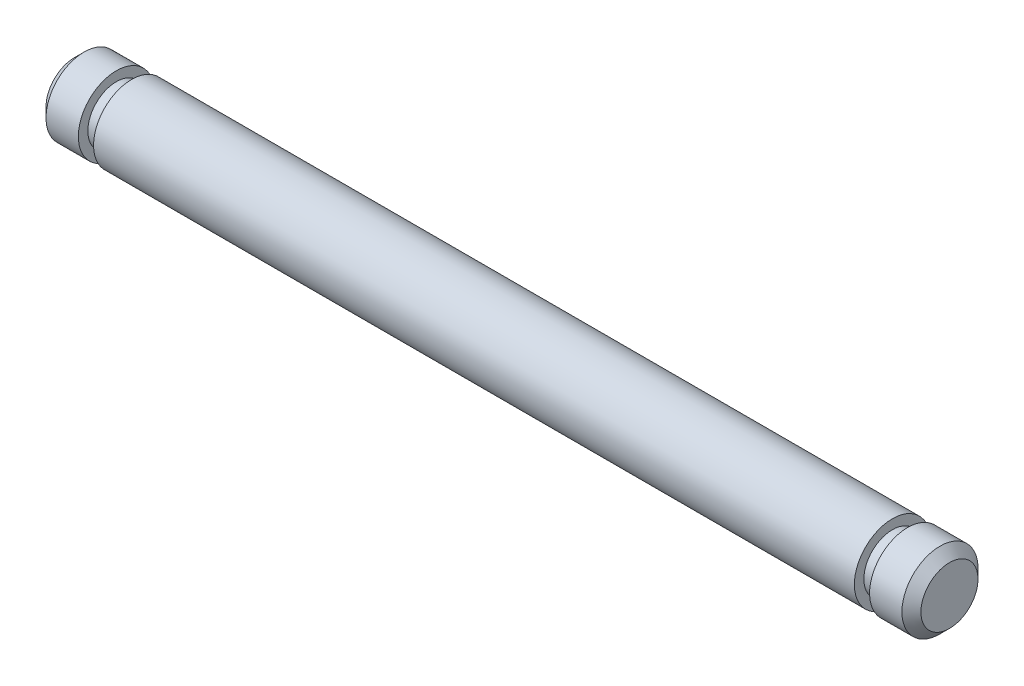
ISO-10303-21;
HEADER;
FILE_DESCRIPTION(('STEP AP214'),'2;1');
FILE_NAME('part.step','',(''),(''),'','','');
FILE_SCHEMA(('AUTOMOTIVE_DESIGN { 1 0 10303 214 1 1 1 1 }'));
ENDSEC;
DATA;
#1=APPLICATION_CONTEXT('core data for automotive mechanical design processes');
#2=APPLICATION_PROTOCOL_DEFINITION('international standard','automotive_design',2000,#1);
#3=PRODUCT_CONTEXT('',#1,'mechanical');
#4=PRODUCT('Part','Part','',(#3));
#5=PRODUCT_RELATED_PRODUCT_CATEGORY('part','',(#4));
#6=PRODUCT_DEFINITION_FORMATION('','',#4);
#7=PRODUCT_DEFINITION_CONTEXT('part definition',#1,'design');
#8=PRODUCT_DEFINITION('design','',#6,#7);
#9=PRODUCT_DEFINITION_SHAPE('','',#8);
#10=(LENGTH_UNIT() NAMED_UNIT(*) SI_UNIT(.MILLI.,.METRE.));
#11=(NAMED_UNIT(*) PLANE_ANGLE_UNIT() SI_UNIT($,.RADIAN.));
#12=(NAMED_UNIT(*) SI_UNIT($,.STERADIAN.) SOLID_ANGLE_UNIT());
#13=UNCERTAINTY_MEASURE_WITH_UNIT(LENGTH_MEASURE(1.E-05),#10,'distance_accuracy_value','');
#14=(GEOMETRIC_REPRESENTATION_CONTEXT(3) GLOBAL_UNCERTAINTY_ASSIGNED_CONTEXT((#13)) GLOBAL_UNIT_ASSIGNED_CONTEXT((#10,
#11,#12)) REPRESENTATION_CONTEXT('',''));
#15=CARTESIAN_POINT('',(0.,0.,0.));
#16=DIRECTION('',(0.,0.,1.));
#17=DIRECTION('',(1.,0.,0.));
#18=AXIS2_PLACEMENT_3D('',#15,#16,#17);
#19=CARTESIAN_POINT('',(46.,2.,0.));
#20=DIRECTION('',(1.,0.,0.));
#21=DIRECTION('',(0.,1.,0.));
#22=AXIS2_PLACEMENT_3D('',#19,#20,#21);
#23=CYLINDRICAL_SURFACE('',#22,2.);
#24=CARTESIAN_POINT('',(43.,2.,0.));
#25=DIRECTION('',(1.,0.,0.));
#26=DIRECTION('',(0.,1.,0.));
#27=AXIS2_PLACEMENT_3D('',#24,#25,#26);
#28=CIRCLE('',#27,2.);
#29=CARTESIAN_POINT('',(43.,4.,0.));
#30=VERTEX_POINT('',#29);
#31=EDGE_CURVE('E61',#30,#30,#28,.T.);
#32=ORIENTED_EDGE('',*,*,#31,.F.);
#33=EDGE_LOOP('',(#32));
#34=FACE_BOUND('',#33,.T.);
#35=CARTESIAN_POINT('',(3.,1.99999999999999,0.));
#36=DIRECTION('',(-1.,0.,0.));
#37=DIRECTION('',(0.,-1.,0.));
#38=AXIS2_PLACEMENT_3D('',#35,#36,#37);
#39=CIRCLE('',#38,1.99999999999999);
#40=CARTESIAN_POINT('',(3.,0.,0.));
#41=VERTEX_POINT('',#40);
#42=EDGE_CURVE('E73',#41,#41,#39,.T.);
#43=ORIENTED_EDGE('',*,*,#42,.F.);
#44=EDGE_LOOP('',(#43));
#45=FACE_BOUND('',#44,.T.);
#46=ADVANCED_FACE('F39',(#34,#45),#23,.T.);
#47=CARTESIAN_POINT('',(45.5,2.,0.));
#48=DIRECTION('',(-1.,0.,0.));
#49=DIRECTION('',(0.,0.,1.));
#50=AXIS2_PLACEMENT_3D('',#47,#48,#49);
#51=CIRCLE('',#50,2.);
#52=CARTESIAN_POINT('',(45.5,2.,2.));
#53=VERTEX_POINT('',#52);
#54=EDGE_CURVE('E10',#53,#53,#51,.T.);
#55=ORIENTED_EDGE('',*,*,#54,.T.);
#56=EDGE_LOOP('',(#55));
#57=FACE_BOUND('',#56,.T.);
#58=CARTESIAN_POINT('',(43.8,2.,0.));
#59=DIRECTION('',(1.,0.,0.));
#60=DIRECTION('',(0.,1.,0.));
#61=AXIS2_PLACEMENT_3D('',#58,#59,#60);
#62=CIRCLE('',#61,2.);
#63=CARTESIAN_POINT('',(43.8,4.,0.));
#64=VERTEX_POINT('',#63);
#65=EDGE_CURVE('E60',#64,#64,#62,.T.);
#66=ORIENTED_EDGE('',*,*,#65,.T.);
#67=EDGE_LOOP('',(#66));
#68=FACE_BOUND('',#67,.T.);
#69=ADVANCED_FACE('F106',(#57,#68),#23,.T.);
#70=CARTESIAN_POINT('',(46.,0.,0.));
#71=DIRECTION('',(-1.,0.,0.));
#72=DIRECTION('',(0.,-1.,0.));
#73=AXIS2_PLACEMENT_3D('',#70,#71,#72);
#74=PLANE('',#73);
#75=CARTESIAN_POINT('',(46.,2.,0.));
#76=DIRECTION('',(-1.,0.,0.));
#77=DIRECTION('',(0.,-1.,0.));
#78=AXIS2_PLACEMENT_3D('',#75,#76,#77);
#79=CIRCLE('',#78,1.5);
#80=CARTESIAN_POINT('',(46.,0.499999999999999,0.));
#81=VERTEX_POINT('',#80);
#82=EDGE_CURVE('E47',#81,#81,#79,.F.);
#83=ORIENTED_EDGE('',*,*,#82,.T.);
#84=EDGE_LOOP('',(#83));
#85=FACE_BOUND('',#84,.T.);
#86=ADVANCED_FACE('F114',(#85),#74,.F.);
#87=CARTESIAN_POINT('',(43.8,2.,0.));
#88=DIRECTION('',(1.,0.,0.));
#89=DIRECTION('',(0.,1.,0.));
#90=AXIS2_PLACEMENT_3D('',#87,#88,#89);
#91=PLANE('',#90);
#92=ORIENTED_EDGE('',*,*,#65,.F.);
#93=EDGE_LOOP('',(#92));
#94=FACE_BOUND('',#93,.T.);
#95=CARTESIAN_POINT('',(43.8,2.,0.));
#96=DIRECTION('',(1.,0.,0.));
#97=DIRECTION('',(0.,1.,0.));
#98=AXIS2_PLACEMENT_3D('',#95,#96,#97);
#99=CIRCLE('',#98,1.5);
#100=CARTESIAN_POINT('',(43.8,3.5,0.));
#101=VERTEX_POINT('',#100);
#102=EDGE_CURVE('E64',#101,#101,#99,.T.);
#103=ORIENTED_EDGE('',*,*,#102,.T.);
#104=EDGE_LOOP('',(#103));
#105=FACE_BOUND('',#104,.T.);
#106=ADVANCED_FACE('F147',(#94,#105),#91,.F.);
#107=CARTESIAN_POINT('',(43.,2.,0.));
#108=DIRECTION('',(1.,0.,0.));
#109=DIRECTION('',(0.,1.,0.));
#110=AXIS2_PLACEMENT_3D('',#107,#108,#109);
#111=PLANE('',#110);
#112=ORIENTED_EDGE('',*,*,#31,.T.);
#113=EDGE_LOOP('',(#112));
#114=FACE_BOUND('',#113,.T.);
#115=CARTESIAN_POINT('',(43.,2.,0.));
#116=DIRECTION('',(1.,0.,0.));
#117=DIRECTION('',(0.,1.,0.));
#118=AXIS2_PLACEMENT_3D('',#115,#116,#117);
#119=CIRCLE('',#118,1.5);
#120=CARTESIAN_POINT('',(43.,3.5,0.));
#121=VERTEX_POINT('',#120);
#122=EDGE_CURVE('E67',#121,#121,#119,.T.);
#123=ORIENTED_EDGE('',*,*,#122,.F.);
#124=EDGE_LOOP('',(#123));
#125=FACE_BOUND('',#124,.T.);
#126=ADVANCED_FACE('F196',(#114,#125),#111,.T.);
#127=CARTESIAN_POINT('',(43.8,2.,0.));
#128=DIRECTION('',(-1.,0.,0.));
#129=DIRECTION('',(0.,-1.,0.));
#130=AXIS2_PLACEMENT_3D('',#127,#128,#129);
#131=CYLINDRICAL_SURFACE('',#130,1.5);
#132=ORIENTED_EDGE('',*,*,#102,.F.);
#133=EDGE_LOOP('',(#132));
#134=FACE_BOUND('',#133,.T.);
#135=ORIENTED_EDGE('',*,*,#122,.T.);
#136=EDGE_LOOP('',(#135));
#137=FACE_BOUND('',#136,.T.);
#138=ADVANCED_FACE('F101',(#134,#137),#131,.T.);
#139=CARTESIAN_POINT('',(2.2,1.99999999999999,0.));
#140=DIRECTION('',(-1.,0.,0.));
#141=DIRECTION('',(0.,-1.,0.));
#142=AXIS2_PLACEMENT_3D('',#139,#140,#141);
#143=PLANE('',#142);
#144=CARTESIAN_POINT('',(2.2,1.99999999999999,0.));
#145=DIRECTION('',(-1.,0.,0.));
#146=DIRECTION('',(0.,-1.,0.));
#147=AXIS2_PLACEMENT_3D('',#144,#145,#146);
#148=CIRCLE('',#147,1.99999999999999);
#149=CARTESIAN_POINT('',(2.2,0.,0.));
#150=VERTEX_POINT('',#149);
#151=EDGE_CURVE('E70',#150,#150,#148,.T.);
#152=ORIENTED_EDGE('',*,*,#151,.F.);
#153=EDGE_LOOP('',(#152));
#154=FACE_BOUND('',#153,.T.);
#155=CARTESIAN_POINT('',(2.2,1.99999999999999,0.));
#156=DIRECTION('',(-1.,0.,0.));
#157=DIRECTION('',(0.,-1.,0.));
#158=AXIS2_PLACEMENT_3D('',#155,#156,#157);
#159=CIRCLE('',#158,1.5);
#160=CARTESIAN_POINT('',(2.2,0.499999999999994,0.));
#161=VERTEX_POINT('',#160);
#162=EDGE_CURVE('E76',#161,#161,#159,.T.);
#163=ORIENTED_EDGE('',*,*,#162,.T.);
#164=EDGE_LOOP('',(#163));
#165=FACE_BOUND('',#164,.T.);
#166=ADVANCED_FACE('F85',(#154,#165),#143,.F.);
#167=CARTESIAN_POINT('',(3.,1.99999999999999,0.));
#168=DIRECTION('',(-1.,0.,0.));
#169=DIRECTION('',(0.,-1.,0.));
#170=AXIS2_PLACEMENT_3D('',#167,#168,#169);
#171=PLANE('',#170);
#172=ORIENTED_EDGE('',*,*,#42,.T.);
#173=EDGE_LOOP('',(#172));
#174=FACE_BOUND('',#173,.T.);
#175=CARTESIAN_POINT('',(3.,1.99999999999999,0.));
#176=DIRECTION('',(-1.,0.,0.));
#177=DIRECTION('',(0.,-1.,0.));
#178=AXIS2_PLACEMENT_3D('',#175,#176,#177);
#179=CIRCLE('',#178,1.5);
#180=CARTESIAN_POINT('',(3.,0.499999999999994,0.));
#181=VERTEX_POINT('',#180);
#182=EDGE_CURVE('E79',#181,#181,#179,.T.);
#183=ORIENTED_EDGE('',*,*,#182,.F.);
#184=EDGE_LOOP('',(#183));
#185=FACE_BOUND('',#184,.T.);
#186=ADVANCED_FACE('F91',(#174,#185),#171,.T.);
#187=CARTESIAN_POINT('',(2.2,1.99999999999999,0.));
#188=DIRECTION('',(1.,0.,0.));
#189=DIRECTION('',(0.,1.,0.));
#190=AXIS2_PLACEMENT_3D('',#187,#188,#189);
#191=CYLINDRICAL_SURFACE('',#190,1.5);
#192=ORIENTED_EDGE('',*,*,#162,.F.);
#193=EDGE_LOOP('',(#192));
#194=FACE_BOUND('',#193,.T.);
#195=ORIENTED_EDGE('',*,*,#182,.T.);
#196=EDGE_LOOP('',(#195));
#197=FACE_BOUND('',#196,.T.);
#198=ADVANCED_FACE('F87',(#194,#197),#191,.T.);
#199=CARTESIAN_POINT('',(0.,1.99999999999999,0.));
#200=DIRECTION('',(1.,0.,0.));
#201=DIRECTION('',(0.,1.,0.));
#202=AXIS2_PLACEMENT_3D('',#199,#200,#201);
#203=PLANE('',#202);
#204=CARTESIAN_POINT('',(0.,1.99999999999999,0.));
#205=DIRECTION('',(1.,0.,0.));
#206=DIRECTION('',(0.,1.,0.));
#207=AXIS2_PLACEMENT_3D('',#204,#205,#206);
#208=CIRCLE('',#207,1.50000000000001);
#209=CARTESIAN_POINT('',(0.,3.50000000000001,0.));
#210=VERTEX_POINT('',#209);
#211=EDGE_CURVE('E51',#210,#210,#208,.F.);
#212=ORIENTED_EDGE('',*,*,#211,.T.);
#213=EDGE_LOOP('',(#212));
#214=FACE_BOUND('',#213,.T.);
#215=ADVANCED_FACE('F90',(#214),#203,.F.);
#216=CARTESIAN_POINT('',(0.49999999999998,1.99999999999999,0.));
#217=DIRECTION('',(1.,0.,0.));
#218=DIRECTION('',(0.,0.,-1.));
#219=AXIS2_PLACEMENT_3D('',#216,#217,#218);
#220=CIRCLE('',#219,2.);
#221=CARTESIAN_POINT('',(0.49999999999998,1.99999999999999,-2.));
#222=VERTEX_POINT('',#221);
#223=EDGE_CURVE('E55',#222,#222,#220,.T.);
#224=ORIENTED_EDGE('',*,*,#223,.T.);
#225=EDGE_LOOP('',(#224));
#226=FACE_BOUND('',#225,.T.);
#227=ORIENTED_EDGE('',*,*,#151,.T.);
#228=EDGE_LOOP('',(#227));
#229=FACE_BOUND('',#228,.T.);
#230=ADVANCED_FACE('F109',(#226,#229),#23,.T.);
#231=CARTESIAN_POINT('',(0.49999999999998,1.99999999999999,0.));
#232=DIRECTION('',(1.,0.,0.));
#233=DIRECTION('',(0.,0.,-1.));
#234=AXIS2_PLACEMENT_3D('',#231,#232,#233);
#235=CONICAL_SURFACE('',#234,2.,0.785398163397451);
#236=ORIENTED_EDGE('',*,*,#211,.F.);
#237=EDGE_LOOP('',(#236));
#238=FACE_BOUND('',#237,.T.);
#239=ORIENTED_EDGE('',*,*,#223,.F.);
#240=EDGE_LOOP('',(#239));
#241=FACE_BOUND('',#240,.T.);
#242=ADVANCED_FACE('F120',(#238,#241),#235,.T.);
#243=CARTESIAN_POINT('',(46.,2.,0.));
#244=DIRECTION('',(-1.,0.,0.));
#245=DIRECTION('',(0.,0.,1.));
#246=AXIS2_PLACEMENT_3D('',#243,#244,#245);
#247=CONICAL_SURFACE('',#246,1.5,0.785398163397451);
#248=ORIENTED_EDGE('',*,*,#54,.F.);
#249=EDGE_LOOP('',(#248));
#250=FACE_BOUND('',#249,.T.);
#251=ORIENTED_EDGE('',*,*,#82,.F.);
#252=EDGE_LOOP('',(#251));
#253=FACE_BOUND('',#252,.T.);
#254=ADVANCED_FACE('F42',(#250,#253),#247,.T.);
#255=CLOSED_SHELL('',(#46,#69,#86,#106,#126,#138,#166,#186,#198,#215,#230,#242,#254));
#256=MANIFOLD_SOLID_BREP('B2',#255);
#257=ADVANCED_BREP_SHAPE_REPRESENTATION('',(#18,#256),#14);
#258=SHAPE_DEFINITION_REPRESENTATION(#9,#257);
ENDSEC;
END-ISO-10303-21;
